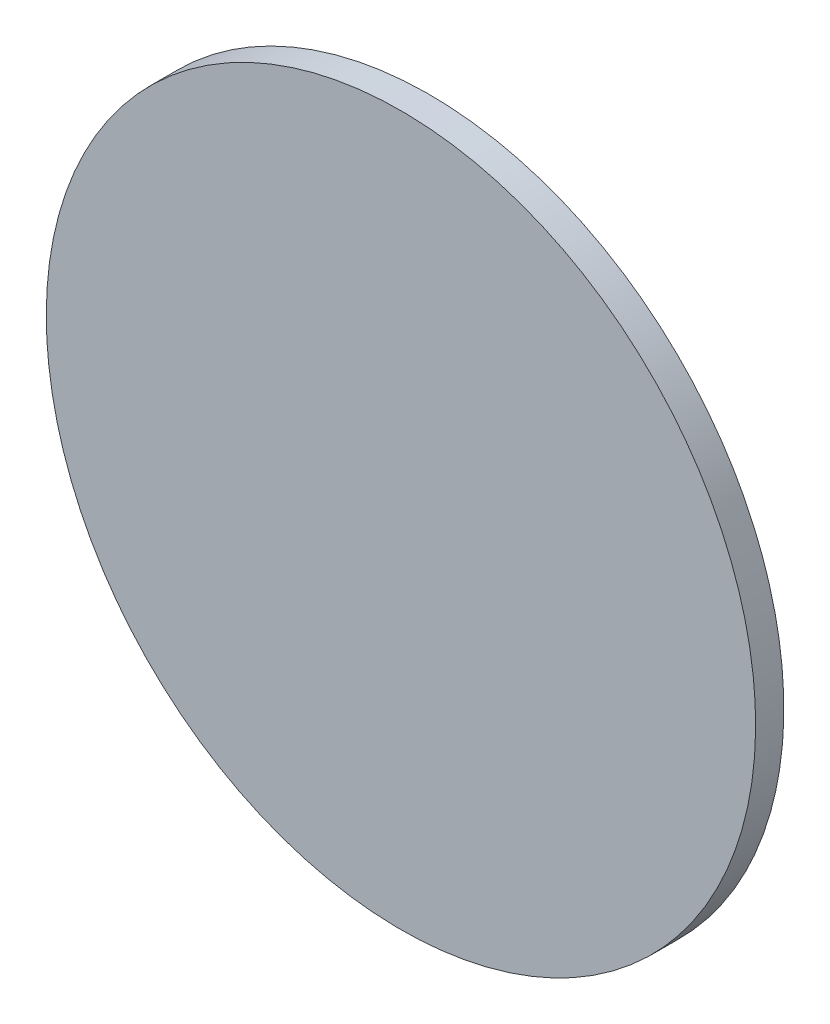
ISO-10303-21;
HEADER;
FILE_DESCRIPTION(('STEP AP214'),'2;1');
FILE_NAME('part.step','',(''),(''),'','','');
FILE_SCHEMA(('AUTOMOTIVE_DESIGN { 1 0 10303 214 1 1 1 1 }'));
ENDSEC;
DATA;
#1=APPLICATION_CONTEXT('core data for automotive mechanical design processes');
#2=APPLICATION_PROTOCOL_DEFINITION('international standard','automotive_design',2000,#1);
#3=PRODUCT_CONTEXT('',#1,'mechanical');
#4=PRODUCT('Part','Part','',(#3));
#5=PRODUCT_RELATED_PRODUCT_CATEGORY('part','',(#4));
#6=PRODUCT_DEFINITION_FORMATION('','',#4);
#7=PRODUCT_DEFINITION_CONTEXT('part definition',#1,'design');
#8=PRODUCT_DEFINITION('design','',#6,#7);
#9=PRODUCT_DEFINITION_SHAPE('','',#8);
#10=(LENGTH_UNIT() NAMED_UNIT(*) SI_UNIT(.MILLI.,.METRE.));
#11=(NAMED_UNIT(*) PLANE_ANGLE_UNIT() SI_UNIT($,.RADIAN.));
#12=(NAMED_UNIT(*) SI_UNIT($,.STERADIAN.) SOLID_ANGLE_UNIT());
#13=UNCERTAINTY_MEASURE_WITH_UNIT(LENGTH_MEASURE(1.E-05),#10,'distance_accuracy_value','');
#14=(GEOMETRIC_REPRESENTATION_CONTEXT(3) GLOBAL_UNCERTAINTY_ASSIGNED_CONTEXT((#13)) GLOBAL_UNIT_ASSIGNED_CONTEXT((#10,
#11,#12)) REPRESENTATION_CONTEXT('',''));
#15=CARTESIAN_POINT('',(0.,0.,0.));
#16=DIRECTION('',(0.,0.,1.));
#17=DIRECTION('',(1.,0.,0.));
#18=AXIS2_PLACEMENT_3D('',#15,#16,#17);
#19=CARTESIAN_POINT('',(0.440241672587601,2.89844450659126,-48.9766497664626));
#20=CARTESIAN_POINT('',(0.440241672587601,3.73970063010618,-48.9766497664626));
#21=CARTESIAN_POINT('',(0.605954664963182,5.42221287713601,-48.9766497664626));
#22=CARTESIAN_POINT('',(1.34211074460719,7.84899424454633,-48.9766497664626));
#23=CARTESIAN_POINT('',(2.53756335003221,10.0855287618273,-48.9766497664626));
#24=CARTESIAN_POINT('',(4.14637190802928,12.0458676617429,-48.9766497664626));
#25=CARTESIAN_POINT('',(6.10671080794483,13.6546762197399,-48.9766497664626));
#26=CARTESIAN_POINT('',(8.34324532522581,14.8501288251649,-48.9766497664626));
#27=CARTESIAN_POINT('',(10.7700266926361,15.586284904809,-48.9766497664626));
#28=CARTESIAN_POINT('',(13.2937950631809,15.8348543933723,-48.9766497664626));
#29=CARTESIAN_POINT('',(15.8175634337256,15.586284904809,-48.9766497664626));
#30=CARTESIAN_POINT('',(18.2443448011359,14.8501288251649,-48.9766497664626));
#31=CARTESIAN_POINT('',(20.4808793184169,13.6546762197399,-48.9766497664626));
#32=CARTESIAN_POINT('',(22.4412182183325,12.0458676617429,-48.9766497664626));
#33=CARTESIAN_POINT('',(24.0500267763295,10.0855287618273,-48.9766497664626));
#34=CARTESIAN_POINT('',(25.2454793817545,7.84899424454633,-48.9766497664626));
#35=CARTESIAN_POINT('',(25.9816354613986,5.42221287713601,-48.9766497664626));
#36=CARTESIAN_POINT('',(26.2302049499619,2.89844450659127,-48.9766497664626));
#37=CARTESIAN_POINT('',(25.9816354613986,0.374676136046518,-48.9766497664626));
#38=CARTESIAN_POINT('',(25.2454793817546,-2.05210523136379,-48.9766497664626));
#39=CARTESIAN_POINT('',(24.0500267763295,-4.28863974864477,-48.9766497664626));
#40=CARTESIAN_POINT('',(22.4412182183325,-6.24897864856032,-48.9766497664626));
#41=CARTESIAN_POINT('',(20.4808793184169,-7.8577872065574,-48.9766497664626));
#42=CARTESIAN_POINT('',(18.2443448011359,-9.05323981198241,-48.9766497664626));
#43=CARTESIAN_POINT('',(15.8175634337256,-9.78939589162643,-48.9766497664626));
#44=CARTESIAN_POINT('',(13.2937950631809,-10.0379653801898,-48.9766497664626));
#45=CARTESIAN_POINT('',(10.7700266926361,-9.78939589162642,-48.9766497664626));
#46=CARTESIAN_POINT('',(8.34324532522582,-9.05323981198241,-48.9766497664626));
#47=CARTESIAN_POINT('',(6.10671080794484,-7.8577872065574,-48.9766497664626));
#48=CARTESIAN_POINT('',(4.14637190802928,-6.24897864856033,-48.9766497664626));
#49=CARTESIAN_POINT('',(2.53756335003221,-4.28863974864478,-48.9766497664626));
#50=CARTESIAN_POINT('',(1.3421107446072,-2.0521052313638,-48.9766497664626));
#51=CARTESIAN_POINT('',(0.605954664963182,0.374676136046509,-48.9766497664626));
#52=CARTESIAN_POINT('',(0.440241672587601,2.05718838307635,-48.9766497664626));
#53=CARTESIAN_POINT('',(0.440241672587601,2.89844450659126,-48.9766497664626));
#54=B_SPLINE_CURVE_WITH_KNOTS('',3,(#19,#20,#21,#22,#23,#24,#25,#26,#27,#28,#29,#30,#31,#32,#33,
#34,#35,#36,#37,#38,#39,#40,#41,#42,#43,#44,#45,#46,#47,#48,#49,#50,#51,#52,#53),.UNSPECIFIED.,
.T.,.F.,(4,1,1,1,1,1,1,1,1,1,1,1,1,1,1,1,1,1,1,1,1,1,1,1,1,1,1,1,1,1,1,1,4),(0.,0.03125,0.0625,
0.09375,0.125,0.15625,0.1875,0.21875,0.25,0.28125,0.3125,0.34375,0.375,0.40625,0.4375,0.46875,
0.5,0.53125,0.5625,0.59375,0.625,0.65625,0.6875,0.71875,0.75,0.78125,0.8125,0.84375,0.875,
0.90625,0.9375,0.96875,1.),.UNSPECIFIED.);
#55=DIRECTION('',(0.,0.,-1.));
#56=VECTOR('',#55,1.);
#57=SURFACE_OF_LINEAR_EXTRUSION('',#54,#56);
#58=CARTESIAN_POINT('',(0.440241672587601,2.89844450659126,-48.9766497664626));
#59=CARTESIAN_POINT('',(0.440241672587601,3.73970063010618,-48.9766497664626));
#60=CARTESIAN_POINT('',(0.605954664963182,5.42221287713601,-48.9766497664626));
#61=CARTESIAN_POINT('',(1.34211074460719,7.84899424454633,-48.9766497664626));
#62=CARTESIAN_POINT('',(2.53756335003221,10.0855287618273,-48.9766497664626));
#63=CARTESIAN_POINT('',(4.14637190802928,12.0458676617429,-48.9766497664626));
#64=CARTESIAN_POINT('',(6.10671080794483,13.6546762197399,-48.9766497664626));
#65=CARTESIAN_POINT('',(8.34324532522581,14.8501288251649,-48.9766497664626));
#66=CARTESIAN_POINT('',(10.7700266926361,15.586284904809,-48.9766497664626));
#67=CARTESIAN_POINT('',(13.2937950631809,15.8348543933723,-48.9766497664626));
#68=CARTESIAN_POINT('',(15.8175634337256,15.586284904809,-48.9766497664626));
#69=CARTESIAN_POINT('',(18.2443448011359,14.8501288251649,-48.9766497664626));
#70=CARTESIAN_POINT('',(20.4808793184169,13.6546762197399,-48.9766497664626));
#71=CARTESIAN_POINT('',(22.4412182183325,12.0458676617429,-48.9766497664626));
#72=CARTESIAN_POINT('',(24.0500267763295,10.0855287618273,-48.9766497664626));
#73=CARTESIAN_POINT('',(25.2454793817545,7.84899424454633,-48.9766497664626));
#74=CARTESIAN_POINT('',(25.9816354613986,5.42221287713601,-48.9766497664626));
#75=CARTESIAN_POINT('',(26.2302049499619,2.89844450659127,-48.9766497664626));
#76=CARTESIAN_POINT('',(25.9816354613986,0.374676136046518,-48.9766497664626));
#77=CARTESIAN_POINT('',(25.2454793817546,-2.05210523136379,-48.9766497664626));
#78=CARTESIAN_POINT('',(24.0500267763295,-4.28863974864477,-48.9766497664626));
#79=CARTESIAN_POINT('',(22.4412182183325,-6.24897864856032,-48.9766497664626));
#80=CARTESIAN_POINT('',(20.4808793184169,-7.8577872065574,-48.9766497664626));
#81=CARTESIAN_POINT('',(18.2443448011359,-9.05323981198241,-48.9766497664626));
#82=CARTESIAN_POINT('',(15.8175634337256,-9.78939589162643,-48.9766497664626));
#83=CARTESIAN_POINT('',(13.2937950631809,-10.0379653801898,-48.9766497664626));
#84=CARTESIAN_POINT('',(10.7700266926361,-9.78939589162642,-48.9766497664626));
#85=CARTESIAN_POINT('',(8.34324532522582,-9.05323981198241,-48.9766497664626));
#86=CARTESIAN_POINT('',(6.10671080794484,-7.8577872065574,-48.9766497664626));
#87=CARTESIAN_POINT('',(4.14637190802928,-6.24897864856033,-48.9766497664626));
#88=CARTESIAN_POINT('',(2.53756335003221,-4.28863974864478,-48.9766497664626));
#89=CARTESIAN_POINT('',(1.3421107446072,-2.0521052313638,-48.9766497664626));
#90=CARTESIAN_POINT('',(0.605954664963182,0.374676136046509,-48.9766497664626));
#91=CARTESIAN_POINT('',(0.440241672587601,2.05718838307635,-48.9766497664626));
#92=CARTESIAN_POINT('',(0.440241672587601,2.89844450659126,-48.9766497664626));
#93=B_SPLINE_CURVE_WITH_KNOTS('',3,(#58,#59,#60,#61,#62,#63,#64,#65,#66,#67,#68,#69,#70,#71,#72,
#73,#74,#75,#76,#77,#78,#79,#80,#81,#82,#83,#84,#85,#86,#87,#88,#89,#90,#91,#92),.UNSPECIFIED.,
.T.,.F.,(4,1,1,1,1,1,1,1,1,1,1,1,1,1,1,1,1,1,1,1,1,1,1,1,1,1,1,1,1,1,1,1,4),(0.,0.03125,0.0625,
0.09375,0.125,0.15625,0.1875,0.21875,0.25,0.28125,0.3125,0.34375,0.375,0.40625,0.4375,0.46875,
0.5,0.53125,0.5625,0.59375,0.625,0.65625,0.6875,0.71875,0.75,0.78125,0.8125,0.84375,0.875,
0.90625,0.9375,0.96875,1.),.UNSPECIFIED.);
#94=CARTESIAN_POINT('',(0.440241672587601,2.89844450659126,-48.9766497664626));
#95=VERTEX_POINT('',#94);
#96=EDGE_CURVE('E9',#95,#95,#93,.T.);
#97=ORIENTED_EDGE('',*,*,#96,.T.);
#98=EDGE_LOOP('',(#97));
#99=FACE_BOUND('',#98,.T.);
#100=CARTESIAN_POINT('',(0.440241672587601,2.89844450659126,-49.9989999999932));
#101=CARTESIAN_POINT('',(0.44024171621153,2.6881291843083,-49.9989999999932));
#102=CARTESIAN_POINT('',(0.445420265443857,2.47781539267348,-49.9989999999932));
#103=CARTESIAN_POINT('',(0.466084594049892,2.05769294415229,-49.9989999999932));
#104=CARTESIAN_POINT('',(0.481570453488696,1.84788429120242,-49.9989999999932));
#105=CARTESIAN_POINT('',(0.522799619882937,1.42927747656596,-49.9989999999932));
#106=CARTESIAN_POINT('',(0.548542926838374,1.22047931487936,-49.9989999999932));
#107=CARTESIAN_POINT('',(0.610237549065363,0.804397555833782,-49.9989999999932));
#108=CARTESIAN_POINT('',(0.646188785041313,0.597113946722527,-49.9989999999932));
#109=CARTESIAN_POINT('',(0.728249408578597,0.184567326415313,-49.9989999999932));
#110=CARTESIAN_POINT('',(0.774358796139931,-0.0206956847806459,-49.9989999999932));
#111=CARTESIAN_POINT('',(0.876588004435237,-0.428714645221233,-49.9989999999932));
#112=CARTESIAN_POINT('',(0.93270790292635,-0.6314705749789,-49.9989999999932));
#113=CARTESIAN_POINT('',(1.05481096984659,-1.03399044311906,-49.9989999999932));
#114=CARTESIAN_POINT('',(1.12079413827573,-1.23375438150155,-49.9989999999932));
#115=CARTESIAN_POINT('',(1.26247684826425,-1.6298052553467,-49.9989999999932));
#116=CARTESIAN_POINT('',(1.33817631434456,-1.82609221780607,-49.9989999999932));
#117=CARTESIAN_POINT('',(1.49914401679683,-2.21470262821175,-49.9989999999932));
#118=CARTESIAN_POINT('',(1.5844122531688,-2.40702607615807,-49.9989999999932));
#119=CARTESIAN_POINT('',(1.76427770686699,-2.78726113987608,-49.9989999999932));
#120=CARTESIAN_POINT('',(1.85887499665454,-2.97517272136555,-49.9989999999932));
#121=CARTESIAN_POINT('',(2.05715961791624,-3.34613715583074,-49.9989999999932));
#122=CARTESIAN_POINT('',(2.16084694939039,-3.52919000880648,-49.9989999999932));
#123=CARTESIAN_POINT('',(2.37707295839063,-3.88998995081817,-49.9989999999932));
#124=CARTESIAN_POINT('',(2.48961156715474,-4.06773708105735,-49.9989999999932));
#125=CARTESIAN_POINT('',(2.7233004504337,-4.41747721044373,-49.9989999999932));
#126=CARTESIAN_POINT('',(2.84445072494855,-4.58947020959092,-49.9989999999932));
#127=CARTESIAN_POINT('',(3.09504029541441,-4.92730915390933,-49.9989999999932));
#128=CARTESIAN_POINT('',(3.2244796557463,-5.09315505132054,-49.9989999999932));
#129=CARTESIAN_POINT('',(3.49132586458563,-5.41830809758107,-49.9989999999932));
#130=CARTESIAN_POINT('',(3.62873271309308,-5.57761524643039,-49.9989999999932));
#131=CARTESIAN_POINT('',(3.91119257683153,-5.88929891700255,-49.9989999999932));
#132=CARTESIAN_POINT('',(4.05624553266015,-6.0416754925517,-49.9989999999932));
#133=CARTESIAN_POINT('',(4.35367506403791,-6.33910502392946,-49.9989999999932));
#134=CARTESIAN_POINT('',(4.50605163958706,-6.48415797975808,-49.9989999999932));
#135=CARTESIAN_POINT('',(4.81773531015923,-6.76661784349654,-49.9989999999932));
#136=CARTESIAN_POINT('',(4.97704245900855,-6.90402469200398,-49.9989999999932));
#137=CARTESIAN_POINT('',(5.30219550526907,-7.17087090084331,-49.9989999999932));
#138=CARTESIAN_POINT('',(5.46804140268025,-7.3003102611752,-49.9989999999932));
#139=CARTESIAN_POINT('',(5.80588034699872,-7.55089983164106,-49.9989999999932));
#140=CARTESIAN_POINT('',(5.97787334614601,-7.67205010615592,-49.9989999999932));
#141=CARTESIAN_POINT('',(6.32761347553214,-7.90573898943487,-49.9989999999932));
#142=CARTESIAN_POINT('',(6.50536060577099,-8.01827759819896,-49.9989999999932));
#143=CARTESIAN_POINT('',(6.86616054778359,-8.23450360719924,-49.9989999999932));
#144=CARTESIAN_POINT('',(7.04921340076056,-8.33819093867346,-49.9989999999932));
#145=CARTESIAN_POINT('',(7.42017783522238,-8.53647555993499,-49.9989999999932));
#146=CARTESIAN_POINT('',(7.60808941670725,-8.63107284972231,-49.9989999999932));
#147=CARTESIAN_POINT('',(7.98832448043784,-8.81093830342112,-49.9989999999932));
#148=CARTESIAN_POINT('',(8.18064792840135,-8.89620653979394,-49.9989999999932));
#149=CARTESIAN_POINT('',(8.56925833876007,-9.05717424224389,-49.9989999999932));
#150=CARTESIAN_POINT('',(8.76554530115528,-9.13287370832103,-49.9989999999932));
#151=CARTESIAN_POINT('',(9.1615961751757,-9.27455641831821,-49.9989999999932));
#152=CARTESIAN_POINT('',(9.36136011379762,-9.34053958675916,-49.9989999999932));
#153=CARTESIAN_POINT('',(9.76387998128365,-9.46264265364711,-49.9989999999932));
#154=CARTESIAN_POINT('',(9.96663591014775,-9.51876255209412,-49.9989999999932));
#155=CARTESIAN_POINT('',(10.3746548730296,-9.62099176050993,-49.9989999999932));
#156=CARTESIAN_POINT('',(10.5799178875603,-9.66710114823588,-49.9989999999932));
#157=CARTESIAN_POINT('',(10.9924644987568,-9.74916177132342,-49.9989999999932));
#158=CARTESIAN_POINT('',(11.1997480954225,-9.78511300668501,-49.9989999999932));
#159=CARTESIAN_POINT('',(11.61582988847,-9.84680763059047,-49.9989999999932));
#160=CARTESIAN_POINT('',(11.8246280966046,-9.87255093983876,-49.9989999999932));
#161=CARTESIAN_POINT('',(12.2432347843431,-9.91378009996882,-49.9989999999932));
#162=CARTESIAN_POINT('',(12.453043263947,-9.92926595085059,-49.9989999999932));
#163=CARTESIAN_POINT('',(12.8731661860562,-9.94993030283479,-49.9989999999932));
#164=CARTESIAN_POINT('',(13.0834806246185,-9.95510888400201,-49.9989999999932));
#165=CARTESIAN_POINT('',(13.5041095017432,-9.95510888400201,-49.9989999999932));
#166=CARTESIAN_POINT('',(13.7144239403056,-9.94993030283479,-49.9989999999932));
#167=CARTESIAN_POINT('',(14.1345468624148,-9.92926595085059,-49.9989999999932));
#168=CARTESIAN_POINT('',(14.3443553420187,-9.91378009996882,-49.9989999999932));
#169=CARTESIAN_POINT('',(14.7629620297572,-9.87255093983877,-49.9989999999932));
#170=CARTESIAN_POINT('',(14.9717602378917,-9.84680763059047,-49.9989999999932));
#171=CARTESIAN_POINT('',(15.3878420309393,-9.78511300668501,-49.9989999999932));
#172=CARTESIAN_POINT('',(15.595125627605,-9.74916177132342,-49.9989999999932));
#173=CARTESIAN_POINT('',(16.0076722388014,-9.66710114823588,-49.9989999999932));
#174=CARTESIAN_POINT('',(16.2129352533322,-9.62099176050993,-49.9989999999932));
#175=CARTESIAN_POINT('',(16.620954216214,-9.51876255209412,-49.9989999999932));
#176=CARTESIAN_POINT('',(16.8237101450781,-9.46264265364711,-49.9989999999932));
#177=CARTESIAN_POINT('',(17.2262300125641,-9.34053958675916,-49.9989999999932));
#178=CARTESIAN_POINT('',(17.4259939511861,-9.27455641831821,-49.9989999999932));
#179=CARTESIAN_POINT('',(17.8220448252065,-9.13287370832103,-49.9989999999932));
#180=CARTESIAN_POINT('',(18.0183317876017,-9.05717424224389,-49.9989999999932));
#181=CARTESIAN_POINT('',(18.4069421979604,-8.89620653979393,-49.9989999999932));
#182=CARTESIAN_POINT('',(18.5992656459239,-8.81093830342111,-49.9989999999932));
#183=CARTESIAN_POINT('',(18.9795007096545,-8.63107284972231,-49.9989999999932));
#184=CARTESIAN_POINT('',(19.1674122911394,-8.53647555993498,-49.9989999999932));
#185=CARTESIAN_POINT('',(19.5383767256012,-8.33819093867345,-49.9989999999932));
#186=CARTESIAN_POINT('',(19.7214295785782,-8.23450360719924,-49.9989999999932));
#187=CARTESIAN_POINT('',(20.0822295205908,-8.01827759819895,-49.9989999999932));
#188=CARTESIAN_POINT('',(20.2599766508296,-7.90573898943486,-49.9989999999932));
#189=CARTESIAN_POINT('',(20.6097167802157,-7.67205010615592,-49.9989999999932));
#190=CARTESIAN_POINT('',(20.781709779363,-7.55089983164106,-49.9989999999932));
#191=CARTESIAN_POINT('',(21.1195487236815,-7.3003102611752,-49.9989999999932));
#192=CARTESIAN_POINT('',(21.2853946210927,-7.17087090084331,-49.9989999999932));
#193=CARTESIAN_POINT('',(21.6105476673532,-6.90402469200398,-49.9989999999932));
#194=CARTESIAN_POINT('',(21.7698548162025,-6.76661784349653,-49.9989999999932));
#195=CARTESIAN_POINT('',(22.0815384867747,-6.48415797975808,-49.9989999999932));
#196=CARTESIAN_POINT('',(22.2339150623238,-6.33910502392946,-49.9989999999932));
#197=CARTESIAN_POINT('',(22.5313445937016,-6.0416754925517,-49.9989999999932));
#198=CARTESIAN_POINT('',(22.6763975495302,-5.88929891700255,-49.9989999999932));
#199=CARTESIAN_POINT('',(22.9588574132687,-5.57761524643038,-49.9989999999932));
#200=CARTESIAN_POINT('',(23.0962642617761,-5.41830809758106,-49.9989999999932));
#201=CARTESIAN_POINT('',(23.3631104706155,-5.09315505132055,-49.9989999999932));
#202=CARTESIAN_POINT('',(23.4925498309473,-4.92730915390936,-49.9989999999932));
#203=CARTESIAN_POINT('',(23.7431394014132,-4.58947020959089,-49.9989999999932));
#204=CARTESIAN_POINT('',(23.8642896759281,-4.4174772104436,-49.9989999999932));
#205=CARTESIAN_POINT('',(24.097978559207,-4.06773708105747,-49.9989999999932));
#206=CARTESIAN_POINT('',(24.2105171679711,-3.88998995081862,-49.9989999999932));
#207=CARTESIAN_POINT('',(24.4267431769714,-3.52919000880602,-49.9989999999932));
#208=CARTESIAN_POINT('',(24.5304305084456,-3.34613715582906,-49.9989999999932));
#209=CARTESIAN_POINT('',(24.7287151297071,-2.97517272136723,-49.9989999999932));
#210=CARTESIAN_POINT('',(24.8233124194945,-2.78726113988237,-49.9989999999932));
#211=CARTESIAN_POINT('',(25.0031778731933,-2.40702607615177,-49.9989999999932));
#212=CARTESIAN_POINT('',(25.0884461095661,-2.21470262818827,-49.9989999999932));
#213=CARTESIAN_POINT('',(25.249413812016,-1.82609221782955,-49.9989999999932));
#214=CARTESIAN_POINT('',(25.3251132780932,-1.62980525543433,-49.9989999999932));
#215=CARTESIAN_POINT('',(25.4667959880904,-1.23375438141391,-49.9989999999932));
#216=CARTESIAN_POINT('',(25.5327791565313,-1.03399044279199,-49.9989999999932));
#217=CARTESIAN_POINT('',(25.6548822234193,-0.631470575305962,-49.9989999999932));
#218=CARTESIAN_POINT('',(25.7110021218663,-0.428714646441855,-49.9989999999932));
#219=CARTESIAN_POINT('',(25.8132313302821,-0.0206956835600264,-49.9989999999932));
#220=CARTESIAN_POINT('',(25.859340718008,0.1845673309707,-49.9989999999932));
#221=CARTESIAN_POINT('',(25.9414013410956,0.59711394216715,-49.9989999999932));
#222=CARTESIAN_POINT('',(25.9773525764572,0.804397538832874,-49.9989999999932));
#223=CARTESIAN_POINT('',(26.0390472003626,1.22047933188041,-49.9989999999932));
#224=CARTESIAN_POINT('',(26.0647905096109,1.42927754001495,-49.9989999999932));
#225=CARTESIAN_POINT('',(26.106019669741,1.84788422775344,-49.9989999999932));
#226=CARTESIAN_POINT('',(26.1215055206227,2.05769270735738,-49.9989999999932));
#227=CARTESIAN_POINT('',(26.1421698726069,2.47781562946656,-49.9989999999932));
#228=CARTESIAN_POINT('',(26.1473484537741,2.68813006802891,-49.9989999999932));
#229=CARTESIAN_POINT('',(26.1473484537741,3.10875894515362,-49.9989999999932));
#230=CARTESIAN_POINT('',(26.1421698726069,3.31907338371597,-49.9989999999932));
#231=CARTESIAN_POINT('',(26.1215055206227,3.73919630582516,-49.9989999999932));
#232=CARTESIAN_POINT('',(26.106019669741,3.9490047854291,-49.9989999999932));
#233=CARTESIAN_POINT('',(26.0647905096109,4.36761147316758,-49.9989999999932));
#234=CARTESIAN_POINT('',(26.0390472003626,4.57640968130212,-49.9989999999932));
#235=CARTESIAN_POINT('',(25.9773525764572,4.99249147434965,-49.9989999999932));
#236=CARTESIAN_POINT('',(25.9414013410956,5.19977507101538,-49.9989999999932));
#237=CARTESIAN_POINT('',(25.859340718008,5.61232168221183,-49.9989999999932));
#238=CARTESIAN_POINT('',(25.8132313302821,5.81758469674256,-49.9989999999932));
#239=CARTESIAN_POINT('',(25.7110021218663,6.22560365962438,-49.9989999999932));
#240=CARTESIAN_POINT('',(25.6548822234192,6.42835958848849,-49.9989999999932));
#241=CARTESIAN_POINT('',(25.5327791565313,6.83087945597452,-49.9989999999932));
#242=CARTESIAN_POINT('',(25.4667959880904,7.03064339459644,-49.9989999999932));
#243=CARTESIAN_POINT('',(25.3251132780932,7.42669426861687,-49.9989999999932));
#244=CARTESIAN_POINT('',(25.249413812016,7.62298123101208,-49.9989999999932));
#245=CARTESIAN_POINT('',(25.0884461095661,8.0115916413708,-49.9989999999932));
#246=CARTESIAN_POINT('',(25.0031778731933,8.20391508933431,-49.9989999999932));
#247=CARTESIAN_POINT('',(24.8233124194944,8.5841501530649,-49.9989999999932));
#248=CARTESIAN_POINT('',(24.7287151297071,8.77206173454976,-49.9989999999932));
#249=CARTESIAN_POINT('',(24.5304305084456,9.14302616901159,-49.9989999999932));
#250=CARTESIAN_POINT('',(24.4267431769714,9.32607902198856,-49.9989999999932));
#251=CARTESIAN_POINT('',(24.2105171679711,9.68687896400116,-49.9989999999932));
#252=CARTESIAN_POINT('',(24.097978559207,9.86462609424,-49.9989999999932));
#253=CARTESIAN_POINT('',(23.8642896759281,10.2143662236261,-49.9989999999932));
#254=CARTESIAN_POINT('',(23.7431394014132,10.3863592227734,-49.9989999999932));
#255=CARTESIAN_POINT('',(23.4925498309473,10.7241981670919,-49.9989999999932));
#256=CARTESIAN_POINT('',(23.3631104706154,10.8900440645031,-49.9989999999932));
#257=CARTESIAN_POINT('',(23.0962642617761,11.2151971107636,-49.9989999999932));
#258=CARTESIAN_POINT('',(22.9588574132687,11.3745042596129,-49.9989999999932));
#259=CARTESIAN_POINT('',(22.6763975495302,11.6861879301851,-49.9989999999932));
#260=CARTESIAN_POINT('',(22.5313445937016,11.8385645057342,-49.9989999999932));
#261=CARTESIAN_POINT('',(22.2339150623238,12.135994037112,-49.9989999999932));
#262=CARTESIAN_POINT('',(22.0815384867747,12.2810469929406,-49.9989999999932));
#263=CARTESIAN_POINT('',(21.7698548162025,12.5635068566791,-49.9989999999932));
#264=CARTESIAN_POINT('',(21.6105476673532,12.7009137051865,-49.9989999999932));
#265=CARTESIAN_POINT('',(21.2853946210927,12.9677599140258,-49.9989999999932));
#266=CARTESIAN_POINT('',(21.1195487236815,13.0971992743577,-49.9989999999932));
#267=CARTESIAN_POINT('',(20.781709779363,13.3477888448236,-49.9989999999932));
#268=CARTESIAN_POINT('',(20.6097167802157,13.4689391193384,-49.9989999999932));
#269=CARTESIAN_POINT('',(20.2599766508296,13.7026280026174,-49.9989999999932));
#270=CARTESIAN_POINT('',(20.0822295205908,13.8151666113815,-49.9989999999932));
#271=CARTESIAN_POINT('',(19.7214295785782,14.0313926203818,-49.9989999999932));
#272=CARTESIAN_POINT('',(19.5383767256012,14.135079951856,-49.9989999999932));
#273=CARTESIAN_POINT('',(19.1674122911394,14.3333645731175,-49.9989999999932));
#274=CARTESIAN_POINT('',(18.9795007096545,14.4279618629048,-49.9989999999932));
#275=CARTESIAN_POINT('',(18.5992656459239,14.6078273166036,-49.9989999999932));
#276=CARTESIAN_POINT('',(18.4069421979604,14.6930955529765,-49.9989999999932));
#277=CARTESIAN_POINT('',(18.0183317876017,14.8540632554264,-49.9989999999932));
#278=CARTESIAN_POINT('',(17.8220448252065,14.9297627215036,-49.9989999999932));
#279=CARTESIAN_POINT('',(17.425993951186,15.0714454315007,-49.9989999999932));
#280=CARTESIAN_POINT('',(17.2262300125641,15.1374285999417,-49.9989999999932));
#281=CARTESIAN_POINT('',(16.8237101450781,15.2595316668296,-49.9989999999932));
#282=CARTESIAN_POINT('',(16.620954216214,15.3156515652766,-49.9989999999932));
#283=CARTESIAN_POINT('',(16.2129352533322,15.4178807736925,-49.9989999999932));
#284=CARTESIAN_POINT('',(16.0076722388014,15.4639901614184,-49.9989999999932));
#285=CARTESIAN_POINT('',(15.595125627605,15.546050784506,-49.9989999999932));
#286=CARTESIAN_POINT('',(15.3878420309393,15.5820020198675,-49.9989999999932));
#287=CARTESIAN_POINT('',(14.9717602378917,15.643696643773,-49.9989999999932));
#288=CARTESIAN_POINT('',(14.7629620297572,15.6694399530213,-49.9989999999932));
#289=CARTESIAN_POINT('',(14.3443553420187,15.7106691131514,-49.9989999999932));
#290=CARTESIAN_POINT('',(14.1345468624148,15.7261549640331,-49.9989999999932));
#291=CARTESIAN_POINT('',(13.7144239403056,15.7468193160173,-49.9989999999932));
#292=CARTESIAN_POINT('',(13.5041095017432,15.7519978971845,-49.9989999999932));
#293=CARTESIAN_POINT('',(13.0834806246185,15.7519978971845,-49.9989999999932));
#294=CARTESIAN_POINT('',(12.8731661860562,15.7468193160173,-49.9989999999932));
#295=CARTESIAN_POINT('',(12.453043263947,15.7261549640331,-49.9989999999932));
#296=CARTESIAN_POINT('',(12.243234784343,15.7106691131513,-49.9989999999932));
#297=CARTESIAN_POINT('',(11.8246280966046,15.6694399530213,-49.9989999999932));
#298=CARTESIAN_POINT('',(11.61582988847,15.643696643773,-49.9989999999932));
#299=CARTESIAN_POINT('',(11.1997480954225,15.5820020198675,-49.9989999999932));
#300=CARTESIAN_POINT('',(10.9924644987568,15.546050784506,-49.9989999999932));
#301=CARTESIAN_POINT('',(10.5799178875603,15.4639901614184,-49.9989999999932));
#302=CARTESIAN_POINT('',(10.3746548730296,15.4178807736925,-49.9989999999932));
#303=CARTESIAN_POINT('',(9.96663591014775,15.3156515652766,-49.9989999999932));
#304=CARTESIAN_POINT('',(9.76387998128365,15.2595316668296,-49.9989999999932));
#305=CARTESIAN_POINT('',(9.36136011379762,15.1374285999417,-49.9989999999932));
#306=CARTESIAN_POINT('',(9.1615961751757,15.0714454315007,-49.9989999999932));
#307=CARTESIAN_POINT('',(8.76554530115527,14.9297627215036,-49.9989999999932));
#308=CARTESIAN_POINT('',(8.56925833876006,14.8540632554264,-49.9989999999932));
#309=CARTESIAN_POINT('',(8.18064792840134,14.6930955529765,-49.9989999999932));
#310=CARTESIAN_POINT('',(7.98832448043783,14.6078273166036,-49.9989999999932));
#311=CARTESIAN_POINT('',(7.60808941670724,14.4279618629048,-49.9989999999932));
#312=CARTESIAN_POINT('',(7.42017783522238,14.3333645731175,-49.9989999999932));
#313=CARTESIAN_POINT('',(7.04921340076055,14.135079951856,-49.9989999999932));
#314=CARTESIAN_POINT('',(6.86616054778358,14.0313926203818,-49.9989999999932));
#315=CARTESIAN_POINT('',(6.50536060577099,13.8151666113815,-49.9989999999932));
#316=CARTESIAN_POINT('',(6.32761347553214,13.7026280026174,-49.9989999999932));
#317=CARTESIAN_POINT('',(5.977873346146,13.4689391193384,-49.9989999999932));
#318=CARTESIAN_POINT('',(5.80588034699872,13.3477888448236,-49.9989999999932));
#319=CARTESIAN_POINT('',(5.46804140268024,13.0971992743577,-49.9989999999932));
#320=CARTESIAN_POINT('',(5.30219550526906,12.9677599140258,-49.9989999999932));
#321=CARTESIAN_POINT('',(4.97704245900855,12.7009137051865,-49.9989999999932));
#322=CARTESIAN_POINT('',(4.81773531015922,12.5635068566791,-49.9989999999932));
#323=CARTESIAN_POINT('',(4.50605163958705,12.2810469929406,-49.9989999999932));
#324=CARTESIAN_POINT('',(4.35367506403791,12.135994037112,-49.9989999999932));
#325=CARTESIAN_POINT('',(4.05624553266015,11.8385645057342,-49.9989999999932));
#326=CARTESIAN_POINT('',(3.91119257683153,11.6861879301851,-49.9989999999932));
#327=CARTESIAN_POINT('',(3.62873271309308,11.3745042596129,-49.9989999999932));
#328=CARTESIAN_POINT('',(3.49132586458563,11.2151971107636,-49.9989999999932));
#329=CARTESIAN_POINT('',(3.2244796557463,10.8900440645031,-49.9989999999932));
#330=CARTESIAN_POINT('',(3.09504029541441,10.7241981670919,-49.9989999999932));
#331=CARTESIAN_POINT('',(2.84445072494855,10.3863592227735,-49.9989999999932));
#332=CARTESIAN_POINT('',(2.7233004504337,10.2143662236263,-49.9989999999932));
#333=CARTESIAN_POINT('',(2.48961156715474,9.86462609423988,-49.9989999999932));
#334=CARTESIAN_POINT('',(2.37707295839063,9.6868789640007,-49.9989999999932));
#335=CARTESIAN_POINT('',(2.16084694939039,9.326079021989,-49.9989999999932));
#336=CARTESIAN_POINT('',(2.05715961791624,9.14302616901327,-49.9989999999932));
#337=CARTESIAN_POINT('',(1.85887499665454,8.77206173454808,-49.9989999999932));
#338=CARTESIAN_POINT('',(1.76427770686699,8.58415015305861,-49.9989999999932));
#339=CARTESIAN_POINT('',(1.5844122531688,8.2039150893406,-49.9989999999932));
#340=CARTESIAN_POINT('',(1.49914401679683,8.01159164139428,-49.9989999999932));
#341=CARTESIAN_POINT('',(1.33817631434456,7.62298123098859,-49.9989999999932));
#342=CARTESIAN_POINT('',(1.26247684826425,7.42669426852923,-49.9989999999932));
#343=CARTESIAN_POINT('',(1.12079413827573,7.03064339468408,-49.9989999999932));
#344=CARTESIAN_POINT('',(1.05481096984659,6.83087945630158,-49.9989999999932));
#345=CARTESIAN_POINT('',(0.93270790292635,6.42835958816143,-49.9989999999932));
#346=CARTESIAN_POINT('',(0.876588004435237,6.22560365840376,-49.9989999999932));
#347=CARTESIAN_POINT('',(0.774358796139931,5.81758469796317,-49.9989999999932));
#348=CARTESIAN_POINT('',(0.728249408578597,5.61232168676721,-49.9989999999932));
#349=CARTESIAN_POINT('',(0.646188785041313,5.19977506646,-49.9989999999932));
#350=CARTESIAN_POINT('',(0.610237549065363,4.99249145734874,-49.9989999999932));
#351=CARTESIAN_POINT('',(0.548542926838374,4.57640969830317,-49.9989999999932));
#352=CARTESIAN_POINT('',(0.522799619882937,4.36761153661657,-49.9989999999932));
#353=CARTESIAN_POINT('',(0.481570453488696,3.94900472198011,-49.9989999999932));
#354=CARTESIAN_POINT('',(0.466084594049892,3.73919606903024,-49.9989999999932));
#355=CARTESIAN_POINT('',(0.445420265443857,3.31907362050905,-49.9989999999932));
#356=CARTESIAN_POINT('',(0.44024171621153,3.10875982887423,-49.9989999999932));
#357=CARTESIAN_POINT('',(0.440241672587601,2.89844450659126,-49.9989999999932));
#358=B_SPLINE_CURVE_WITH_KNOTS('',3,(#100,#101,#102,#103,#104,#105,#106,#107,#108,#109,#110,
#111,#112,#113,#114,#115,#116,#117,#118,#119,#120,#121,#122,#123,#124,#125,#126,#127,#128,#129,
#130,#131,#132,#133,#134,#135,#136,#137,#138,#139,#140,#141,#142,#143,#144,#145,#146,#147,#148,
#149,#150,#151,#152,#153,#154,#155,#156,#157,#158,#159,#160,#161,#162,#163,#164,#165,#166,#167,
#168,#169,#170,#171,#172,#173,#174,#175,#176,#177,#178,#179,#180,#181,#182,#183,#184,#185,#186,
#187,#188,#189,#190,#191,#192,#193,#194,#195,#196,#197,#198,#199,#200,#201,#202,#203,#204,#205,
#206,#207,#208,#209,#210,#211,#212,#213,#214,#215,#216,#217,#218,#219,#220,#221,#222,#223,#224,
#225,#226,#227,#228,#229,#230,#231,#232,#233,#234,#235,#236,#237,#238,#239,#240,#241,#242,#243,
#244,#245,#246,#247,#248,#249,#250,#251,#252,#253,#254,#255,#256,#257,#258,#259,#260,#261,#262,
#263,#264,#265,#266,#267,#268,#269,#270,#271,#272,#273,#274,#275,#276,#277,#278,#279,#280,#281,
#282,#283,#284,#285,#286,#287,#288,#289,#290,#291,#292,#293,#294,#295,#296,#297,#298,#299,#300,
#301,#302,#303,#304,#305,#306,#307,#308,#309,#310,#311,#312,#313,#314,#315,#316,#317,#318,#319,
#320,#321,#322,#323,#324,#325,#326,#327,#328,#329,#330,#331,#332,#333,#334,#335,#336,#337,#338,
#339,#340,#341,#342,#343,#344,#345,#346,#347,#348,#349,#350,#351,#352,#353,#354,#355,#356,#357),
.UNSPECIFIED.,.F.,.F.,(4,2,2,2,2,2,2,2,2,2,2,2,2,2,2,2,2,2,2,2,2,2,2,2,2,2,2,2,2,2,2,2,2,2,2,2,
2,2,2,2,2,2,2,2,2,2,2,2,2,2,2,2,2,2,2,2,2,2,2,2,2,2,2,2,2,2,2,2,2,2,2,2,2,2,2,2,2,2,2,2,2,2,2,2,
2,2,2,2,2,2,2,2,2,2,2,2,2,2,2,2,2,2,2,2,2,2,2,2,2,2,2,2,2,2,2,2,2,2,2,2,2,2,2,2,2,2,2,2,4),(0.,
0.630880223102108,1.26176534681108,1.89265047052006,2.52353069362217,3.15441091672427,
3.78529604043324,4.41618116414221,5.04706138724432,5.67794161034643,6.3088267340554,
6.93971185776437,7.57059208086648,8.20147230396859,8.83235742767756,9.46324255138653,
10.0941227744886,10.7250029975907,11.3558881212997,11.9867732450087,12.6176534681108,
13.2485336912129,13.8794188149219,14.5103039386309,15.141184161733,15.7720643848351,
16.402949508544,17.033834632253,17.6647148553551,18.2955950784572,18.9264802021662,
19.5573653258752,20.1882455489773,20.8191257720794,21.4500108957884,22.0808960194973,
22.7117762425994,23.3426564657015,23.9735415894105,24.6044267131195,25.2353069362216,
25.8661871593237,26.4970722830327,27.1279574067416,27.7588376298437,28.3897178529459,
29.0206029766548,29.6514881003638,30.2823683234659,30.913248546568,31.544133670277,
32.175018793986,32.8058990170881,33.4367792401902,34.0676643638991,34.6985494876081,
35.3294297107102,35.9603099338123,36.5911950575213,37.2220801812303,37.8529604043324,
38.4838406274345,39.1147257511435,39.7456108748524,40.3764910979545,41.0073713210566,
41.6382564447656,42.2691415684746,42.9000217915767,43.5309020146788,44.1617871383878,
44.7926722620967,45.4235524851988,46.054432708301,46.6853178320099,47.3162029557189,
47.947083178821,48.5779634019231,49.2088485256321,49.8397336493411,50.4706138724432,
51.1014940955453,51.7323792192542,52.3632643429632,52.9941445660653,53.6250247891674,
54.2559099128764,54.8867950365854,55.5176752596875,56.1485554827896,56.7794406064986,
57.4103257302075,58.0412059533096,58.6720861764117,59.3029713001207,59.9338564238297,
60.5647366469318,61.1956168700339,61.8265019937429,62.4573871174518,63.0882673405539,
63.7191475636561,64.350032687365,64.980917811074,65.6117980341761,66.2426782572782,
66.8735633809872,67.5044485046962,68.1353287277983,68.7662089509004,69.3970940746093,
70.0279791983183,70.6588594214204,71.2897396445225,71.9206247682315,72.5515098919405,
73.1823901150426,73.8132703381447,74.4441554618537,75.0750405855626,75.7059208086647,
76.3368010317668,76.9676861554758,77.5985712791848,78.2294515022869,78.860331725389,
79.491216849098,80.1221019728069,80.752982195909),.UNSPECIFIED.);
#359=CARTESIAN_POINT('',(0.440241672587601,2.89844450659126,-49.9989999999932));
#360=VERTEX_POINT('',#359);
#361=EDGE_CURVE('E24',#360,#360,#358,.F.);
#362=ORIENTED_EDGE('',*,*,#361,.F.);
#363=EDGE_LOOP('',(#362));
#364=FACE_BOUND('',#363,.T.);
#365=ADVANCED_FACE('F14',(#99,#364),#57,.T.);
#366=CARTESIAN_POINT('',(25.7937950631809,2.89844450659127,-48.9766497664626));
#367=DIRECTION('',(0.,0.,-1.));
#368=DIRECTION('',(0.,1.,0.));
#369=AXIS2_PLACEMENT_3D('',#366,#367,#368);
#370=PLANE('',#369);
#371=ORIENTED_EDGE('',*,*,#96,.F.);
#372=EDGE_LOOP('',(#371));
#373=FACE_BOUND('',#372,.T.);
#374=ADVANCED_FACE('F62',(#373),#370,.F.);
#375=CARTESIAN_POINT('',(25.7937950631809,2.89844450659127,-49.9989999999932));
#376=DIRECTION('',(0.,0.,-1.));
#377=DIRECTION('',(0.,1.,0.));
#378=AXIS2_PLACEMENT_3D('',#375,#376,#377);
#379=PLANE('',#378);
#380=ORIENTED_EDGE('',*,*,#361,.T.);
#381=EDGE_LOOP('',(#380));
#382=FACE_BOUND('',#381,.T.);
#383=ADVANCED_FACE('F31',(#382),#379,.T.);
#384=CLOSED_SHELL('',(#365,#374,#383));
#385=MANIFOLD_SOLID_BREP('B1',#384);
#386=ADVANCED_BREP_SHAPE_REPRESENTATION('',(#18,#385),#14);
#387=SHAPE_DEFINITION_REPRESENTATION(#9,#386);
ENDSEC;
END-ISO-10303-21;
